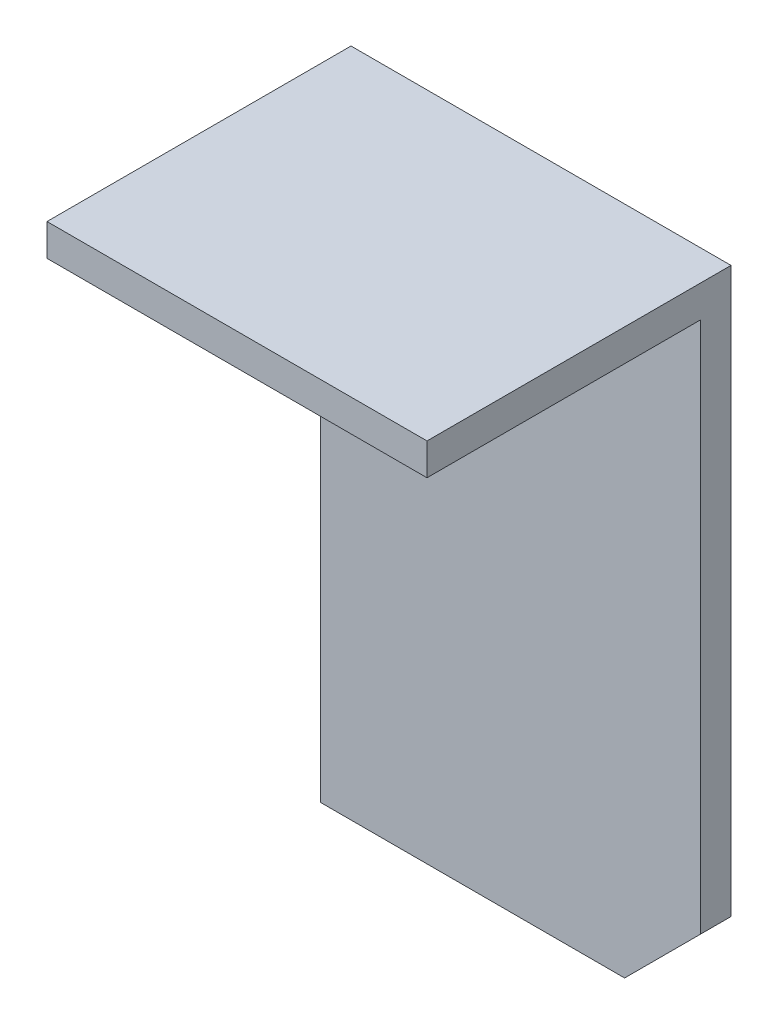
ISO-10303-21;
HEADER;
FILE_DESCRIPTION(('STEP AP214'),'2;1');
FILE_NAME('part.step','',(''),(''),'','','');
FILE_SCHEMA(('AUTOMOTIVE_DESIGN { 1 0 10303 214 1 1 1 1 }'));
ENDSEC;
DATA;
#1=APPLICATION_CONTEXT('core data for automotive mechanical design processes');
#2=APPLICATION_PROTOCOL_DEFINITION('international standard','automotive_design',2000,#1);
#3=PRODUCT_CONTEXT('',#1,'mechanical');
#4=PRODUCT('Part','Part','',(#3));
#5=PRODUCT_RELATED_PRODUCT_CATEGORY('part','',(#4));
#6=PRODUCT_DEFINITION_FORMATION('','',#4);
#7=PRODUCT_DEFINITION_CONTEXT('part definition',#1,'design');
#8=PRODUCT_DEFINITION('design','',#6,#7);
#9=PRODUCT_DEFINITION_SHAPE('','',#8);
#10=(LENGTH_UNIT() NAMED_UNIT(*) SI_UNIT(.MILLI.,.METRE.));
#11=(NAMED_UNIT(*) PLANE_ANGLE_UNIT() SI_UNIT($,.RADIAN.));
#12=(NAMED_UNIT(*) SI_UNIT($,.STERADIAN.) SOLID_ANGLE_UNIT());
#13=UNCERTAINTY_MEASURE_WITH_UNIT(LENGTH_MEASURE(1.E-05),#10,'distance_accuracy_value','');
#14=(GEOMETRIC_REPRESENTATION_CONTEXT(3) GLOBAL_UNCERTAINTY_ASSIGNED_CONTEXT((#13)) GLOBAL_UNIT_ASSIGNED_CONTEXT((#10,
#11,#12)) REPRESENTATION_CONTEXT('',''));
#15=CARTESIAN_POINT('',(0.,0.,0.));
#16=DIRECTION('',(0.,0.,1.));
#17=DIRECTION('',(1.,0.,0.));
#18=AXIS2_PLACEMENT_3D('',#15,#16,#17);
#19=CARTESIAN_POINT('',(0.721679300404558,1.5105,0.2));
#20=DIRECTION('',(0.,0.,1.));
#21=DIRECTION('',(0.,-1.,0.));
#22=AXIS2_PLACEMENT_3D('',#19,#20,#21);
#23=PLANE('',#22);
#24=DIRECTION('',(1.,0.,0.));
#25=VECTOR('',#24,1.);
#26=CARTESIAN_POINT('',(0.721679300404558,1.521,0.2));
#27=LINE('',#26,#25);
#28=CARTESIAN_POINT('',(0.596679300404558,1.521,0.2));
#29=VERTEX_POINT('',#28);
#30=CARTESIAN_POINT('',(0.846679300404558,1.521,0.2));
#31=VERTEX_POINT('',#30);
#32=EDGE_CURVE('E19',#29,#31,#27,.T.);
#33=ORIENTED_EDGE('',*,*,#32,.F.);
#34=DIRECTION('',(0.,-1.,0.));
#35=VECTOR('',#34,1.);
#36=CARTESIAN_POINT('',(0.59667930040456,1.36847101449276,0.2));
#37=LINE('',#36,#35);
#38=CARTESIAN_POINT('',(0.596679300404559,1.5,0.2));
#39=VERTEX_POINT('',#38);
#40=EDGE_CURVE('E99',#29,#39,#37,.T.);
#41=ORIENTED_EDGE('',*,*,#40,.T.);
#42=DIRECTION('',(1.,0.,0.));
#43=VECTOR('',#42,1.);
#44=CARTESIAN_POINT('',(0.721679300404558,1.5,0.2));
#45=LINE('',#44,#43);
#46=CARTESIAN_POINT('',(0.846679300404558,1.5,0.2));
#47=VERTEX_POINT('',#46);
#48=EDGE_CURVE('E11',#39,#47,#45,.T.);
#49=ORIENTED_EDGE('',*,*,#48,.T.);
#50=DIRECTION('',(0.,-1.,0.));
#51=VECTOR('',#50,1.);
#52=CARTESIAN_POINT('',(0.846679300404558,1.39066637478109,0.2));
#53=LINE('',#52,#51);
#54=EDGE_CURVE('E150',#31,#47,#53,.T.);
#55=ORIENTED_EDGE('',*,*,#54,.F.);
#56=EDGE_LOOP('',(#33,#41,#49,#55));
#57=FACE_BOUND('',#56,.T.);
#58=ADVANCED_FACE('F16',(#57),#23,.T.);
#59=CARTESIAN_POINT('',(0.721679300404558,1.5,0.11));
#60=DIRECTION('',(0.,1.,0.));
#61=DIRECTION('',(1.,0.,0.));
#62=AXIS2_PLACEMENT_3D('',#59,#60,#61);
#63=PLANE('',#62);
#64=DIRECTION('',(0.,0.,-1.));
#65=VECTOR('',#64,1.);
#66=CARTESIAN_POINT('',(0.596679300404559,1.5,0.0420289855072459));
#67=LINE('',#66,#65);
#68=CARTESIAN_POINT('',(0.59667930040456,1.5,0.02));
#69=VERTEX_POINT('',#68);
#70=EDGE_CURVE('E91',#39,#69,#67,.T.);
#71=ORIENTED_EDGE('',*,*,#70,.T.);
#72=DIRECTION('',(-1.,0.,0.));
#73=VECTOR('',#72,1.);
#74=CARTESIAN_POINT('',(0.718390642915411,1.5,0.02));
#75=LINE('',#74,#73);
#76=CARTESIAN_POINT('',(0.846679300404558,1.5,0.02));
#77=VERTEX_POINT('',#76);
#78=EDGE_CURVE('E26',#77,#69,#75,.T.);
#79=ORIENTED_EDGE('',*,*,#78,.F.);
#80=DIRECTION('',(0.,0.,-1.));
#81=VECTOR('',#80,1.);
#82=CARTESIAN_POINT('',(0.846679300404558,1.5,0.0448336252189141));
#83=LINE('',#82,#81);
#84=EDGE_CURVE('E94',#47,#77,#83,.T.);
#85=ORIENTED_EDGE('',*,*,#84,.F.);
#86=ORIENTED_EDGE('',*,*,#48,.F.);
#87=EDGE_LOOP('',(#71,#79,#85,#86));
#88=FACE_BOUND('',#87,.T.);
#89=ADVANCED_FACE('F89',(#88),#63,.F.);
#90=CARTESIAN_POINT('',(0.718390642915411,1.30501737448109,0.02));
#91=DIRECTION('',(0.,0.,1.));
#92=DIRECTION('',(0.,-1.,0.));
#93=AXIS2_PLACEMENT_3D('',#90,#91,#92);
#94=PLANE('',#93);
#95=DIRECTION('',(0.,-1.,0.));
#96=VECTOR('',#95,1.);
#97=CARTESIAN_POINT('',(0.59667930040456,1.36847101449276,0.02));
#98=LINE('',#97,#96);
#99=CARTESIAN_POINT('',(0.59667930040456,1.1,0.02));
#100=VERTEX_POINT('',#99);
#101=EDGE_CURVE('E108',#69,#100,#98,.T.);
#102=ORIENTED_EDGE('',*,*,#101,.T.);
#103=DIRECTION('',(1.,0.,0.));
#104=VECTOR('',#103,1.);
#105=CARTESIAN_POINT('',(0.696679300404561,1.1,0.02));
#106=LINE('',#105,#104);
#107=CARTESIAN_POINT('',(0.79667930040456,1.1,0.02));
#108=VERTEX_POINT('',#107);
#109=EDGE_CURVE('E40',#100,#108,#106,.T.);
#110=ORIENTED_EDGE('',*,*,#109,.T.);
#111=DIRECTION('',(0.707106781186552,0.707106781186543,0.));
#112=VECTOR('',#111,1.);
#113=CARTESIAN_POINT('',(0.821679300404559,1.125,0.02));
#114=LINE('',#113,#112);
#115=CARTESIAN_POINT('',(0.84667930040456,1.15,0.02));
#116=VERTEX_POINT('',#115);
#117=EDGE_CURVE('E154',#108,#116,#114,.T.);
#118=ORIENTED_EDGE('',*,*,#117,.T.);
#119=DIRECTION('',(0.,-1.,0.));
#120=VECTOR('',#119,1.);
#121=CARTESIAN_POINT('',(0.846679300404558,1.39066637478109,0.02));
#122=LINE('',#121,#120);
#123=EDGE_CURVE('E162',#77,#116,#122,.T.);
#124=ORIENTED_EDGE('',*,*,#123,.F.);
#125=ORIENTED_EDGE('',*,*,#78,.T.);
#126=EDGE_LOOP('',(#102,#110,#118,#124,#125));
#127=FACE_BOUND('',#126,.T.);
#128=ADVANCED_FACE('F229',(#127),#94,.T.);
#129=CARTESIAN_POINT('',(0.696679300404561,1.1,0.01));
#130=DIRECTION('',(0.,1.,0.));
#131=DIRECTION('',(1.,0.,0.));
#132=AXIS2_PLACEMENT_3D('',#129,#130,#131);
#133=PLANE('',#132);
#134=DIRECTION('',(0.,0.,1.));
#135=VECTOR('',#134,1.);
#136=CARTESIAN_POINT('',(0.79667930040456,1.1,0.01));
#137=LINE('',#136,#135);
#138=CARTESIAN_POINT('',(0.79667930040456,1.1,0.));
#139=VERTEX_POINT('',#138);
#140=EDGE_CURVE('E157',#139,#108,#137,.T.);
#141=ORIENTED_EDGE('',*,*,#140,.T.);
#142=ORIENTED_EDGE('',*,*,#109,.F.);
#143=DIRECTION('',(0.,0.,-1.));
#144=VECTOR('',#143,1.);
#145=CARTESIAN_POINT('',(0.596679300404561,1.1,0.0420289855072459));
#146=LINE('',#145,#144);
#147=CARTESIAN_POINT('',(0.59667930040456,1.1,0.));
#148=VERTEX_POINT('',#147);
#149=EDGE_CURVE('E149',#100,#148,#146,.T.);
#150=ORIENTED_EDGE('',*,*,#149,.T.);
#151=DIRECTION('',(1.,0.,0.));
#152=VECTOR('',#151,1.);
#153=CARTESIAN_POINT('',(0.718495863065479,1.1,0.));
#154=LINE('',#153,#152);
#155=EDGE_CURVE('E129',#148,#139,#154,.T.);
#156=ORIENTED_EDGE('',*,*,#155,.T.);
#157=EDGE_LOOP('',(#141,#142,#150,#156));
#158=FACE_BOUND('',#157,.T.);
#159=ADVANCED_FACE('F223',(#158),#133,.F.);
#160=CARTESIAN_POINT('',(0.821679300404559,1.125,0.01));
#161=DIRECTION('',(-0.707106781186543,0.707106781186552,0.));
#162=DIRECTION('',(0.,0.,1.));
#163=AXIS2_PLACEMENT_3D('',#160,#161,#162);
#164=PLANE('',#163);
#165=DIRECTION('',(0.,0.,-1.));
#166=VECTOR('',#165,1.);
#167=CARTESIAN_POINT('',(0.846679300404559,1.15,0.0448336252189141));
#168=LINE('',#167,#166);
#169=CARTESIAN_POINT('',(0.84667930040456,1.15,0.));
#170=VERTEX_POINT('',#169);
#171=EDGE_CURVE('E120',#116,#170,#168,.T.);
#172=ORIENTED_EDGE('',*,*,#171,.F.);
#173=ORIENTED_EDGE('',*,*,#117,.F.);
#174=ORIENTED_EDGE('',*,*,#140,.F.);
#175=DIRECTION('',(0.707106781186546,0.707106781186549,0.));
#176=VECTOR('',#175,1.);
#177=CARTESIAN_POINT('',(0.79667930040456,1.1,0.));
#178=LINE('',#177,#176);
#179=EDGE_CURVE('E125',#139,#170,#178,.T.);
#180=ORIENTED_EDGE('',*,*,#179,.T.);
#181=EDGE_LOOP('',(#172,#173,#174,#180));
#182=FACE_BOUND('',#181,.T.);
#183=ADVANCED_FACE('F228',(#182),#164,.F.);
#184=CARTESIAN_POINT('',(0.846679300404558,1.39066637478109,0.0448336252189141));
#185=DIRECTION('',(1.,0.,0.));
#186=DIRECTION('',(0.,1.,0.));
#187=AXIS2_PLACEMENT_3D('',#184,#185,#186);
#188=PLANE('',#187);
#189=DIRECTION('',(0.,0.,-1.));
#190=VECTOR('',#189,1.);
#191=CARTESIAN_POINT('',(0.846679300404558,1.521,0.0999999999999988));
#192=LINE('',#191,#190);
#193=CARTESIAN_POINT('',(0.846679300404558,1.521,0.));
#194=VERTEX_POINT('',#193);
#195=EDGE_CURVE('E153',#31,#194,#192,.T.);
#196=ORIENTED_EDGE('',*,*,#195,.F.);
#197=ORIENTED_EDGE('',*,*,#54,.T.);
#198=ORIENTED_EDGE('',*,*,#84,.T.);
#199=ORIENTED_EDGE('',*,*,#123,.T.);
#200=ORIENTED_EDGE('',*,*,#171,.T.);
#201=DIRECTION('',(0.,1.,0.));
#202=VECTOR('',#201,1.);
#203=CARTESIAN_POINT('',(0.84667930040456,1.31559112123516,0.));
#204=LINE('',#203,#202);
#205=EDGE_CURVE('E122',#170,#194,#204,.T.);
#206=ORIENTED_EDGE('',*,*,#205,.T.);
#207=EDGE_LOOP('',(#196,#197,#198,#199,#200,#206));
#208=FACE_BOUND('',#207,.T.);
#209=ADVANCED_FACE('F184',(#208),#188,.T.);
#210=CARTESIAN_POINT('',(0.721679300404558,1.521,0.0999999999999988));
#211=DIRECTION('',(0.,1.,0.));
#212=DIRECTION('',(1.,0.,0.));
#213=AXIS2_PLACEMENT_3D('',#210,#211,#212);
#214=PLANE('',#213);
#215=ORIENTED_EDGE('',*,*,#32,.T.);
#216=ORIENTED_EDGE('',*,*,#195,.T.);
#217=DIRECTION('',(-1.,0.,0.));
#218=VECTOR('',#217,1.);
#219=CARTESIAN_POINT('',(0.718495863065479,1.521,0.));
#220=LINE('',#219,#218);
#221=CARTESIAN_POINT('',(0.596679300404558,1.521,0.));
#222=VERTEX_POINT('',#221);
#223=EDGE_CURVE('E126',#194,#222,#220,.T.);
#224=ORIENTED_EDGE('',*,*,#223,.T.);
#225=DIRECTION('',(0.,0.,1.));
#226=VECTOR('',#225,1.);
#227=CARTESIAN_POINT('',(0.596679300404559,1.521,0.0420289855072459));
#228=LINE('',#227,#226);
#229=EDGE_CURVE('E104',#222,#29,#228,.T.);
#230=ORIENTED_EDGE('',*,*,#229,.T.);
#231=EDGE_LOOP('',(#215,#216,#224,#230));
#232=FACE_BOUND('',#231,.T.);
#233=ADVANCED_FACE('F179',(#232),#214,.T.);
#234=CARTESIAN_POINT('',(0.59667930040456,1.36847101449276,0.0420289855072459));
#235=DIRECTION('',(1.,0.,0.));
#236=DIRECTION('',(0.,1.,0.));
#237=AXIS2_PLACEMENT_3D('',#234,#235,#236);
#238=PLANE('',#237);
#239=ORIENTED_EDGE('',*,*,#101,.F.);
#240=ORIENTED_EDGE('',*,*,#70,.F.);
#241=ORIENTED_EDGE('',*,*,#40,.F.);
#242=ORIENTED_EDGE('',*,*,#229,.F.);
#243=DIRECTION('',(0.,-1.,0.));
#244=VECTOR('',#243,1.);
#245=CARTESIAN_POINT('',(0.596679300404558,1.31559112123516,0.));
#246=LINE('',#245,#244);
#247=EDGE_CURVE('E116',#222,#148,#246,.T.);
#248=ORIENTED_EDGE('',*,*,#247,.T.);
#249=ORIENTED_EDGE('',*,*,#149,.F.);
#250=EDGE_LOOP('',(#239,#240,#241,#242,#248,#249));
#251=FACE_BOUND('',#250,.T.);
#252=ADVANCED_FACE('F106',(#251),#238,.F.);
#253=CARTESIAN_POINT('',(0.718495863065479,1.31559112123516,0.));
#254=DIRECTION('',(0.,0.,1.));
#255=DIRECTION('',(0.,-1.,0.));
#256=AXIS2_PLACEMENT_3D('',#253,#254,#255);
#257=PLANE('',#256);
#258=ORIENTED_EDGE('',*,*,#223,.F.);
#259=ORIENTED_EDGE('',*,*,#205,.F.);
#260=ORIENTED_EDGE('',*,*,#179,.F.);
#261=ORIENTED_EDGE('',*,*,#155,.F.);
#262=ORIENTED_EDGE('',*,*,#247,.F.);
#263=EDGE_LOOP('',(#258,#259,#260,#261,#262));
#264=FACE_BOUND('',#263,.T.);
#265=ADVANCED_FACE('F190',(#264),#257,.F.);
#266=CLOSED_SHELL('',(#58,#89,#128,#159,#183,#209,#233,#252,#265));
#267=MANIFOLD_SOLID_BREP('B1',#266);
#268=ADVANCED_BREP_SHAPE_REPRESENTATION('',(#18,#267),#14);
#269=SHAPE_DEFINITION_REPRESENTATION(#9,#268);
ENDSEC;
END-ISO-10303-21;
